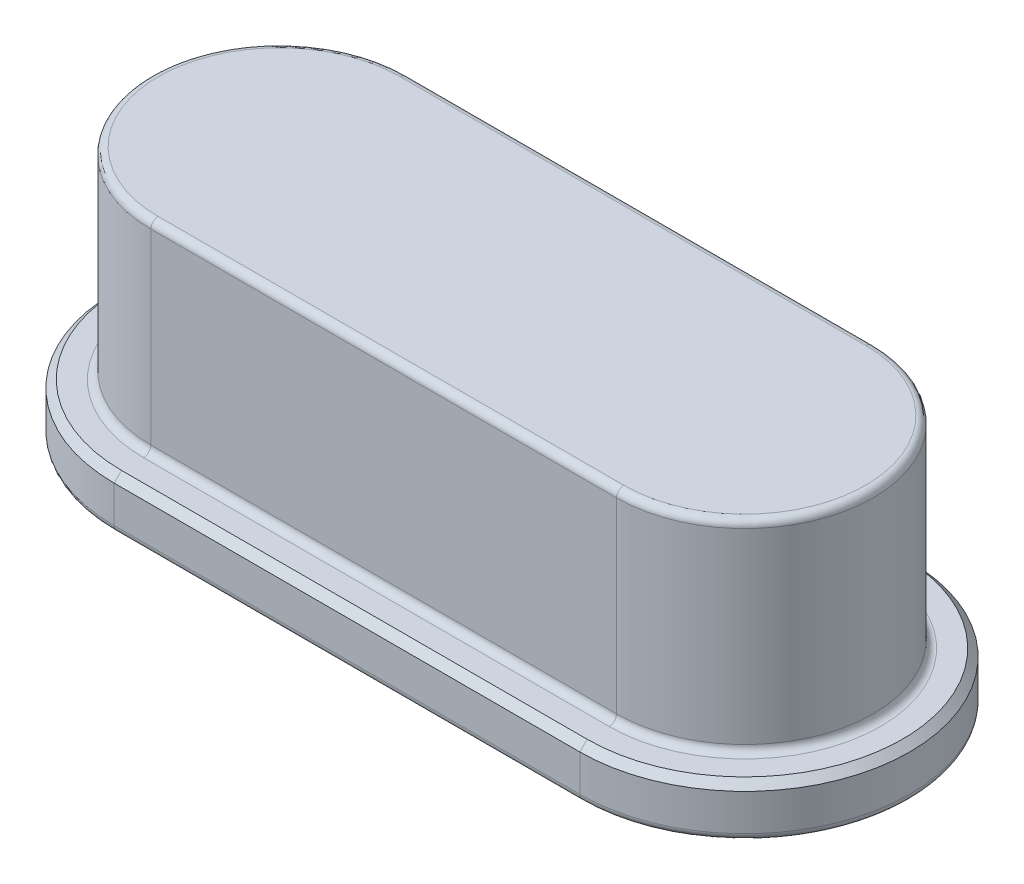
ISO-10303-21;
HEADER;
FILE_DESCRIPTION(('STEP AP214'),'2;1');
FILE_NAME('part.step','',(''),(''),'','','');
FILE_SCHEMA(('AUTOMOTIVE_DESIGN { 1 0 10303 214 1 1 1 1 }'));
ENDSEC;
DATA;
#1=APPLICATION_CONTEXT('core data for automotive mechanical design processes');
#2=APPLICATION_PROTOCOL_DEFINITION('international standard','automotive_design',2000,#1);
#3=PRODUCT_CONTEXT('',#1,'mechanical');
#4=PRODUCT('Part','Part','',(#3));
#5=PRODUCT_RELATED_PRODUCT_CATEGORY('part','',(#4));
#6=PRODUCT_DEFINITION_FORMATION('','',#4);
#7=PRODUCT_DEFINITION_CONTEXT('part definition',#1,'design');
#8=PRODUCT_DEFINITION('design','',#6,#7);
#9=PRODUCT_DEFINITION_SHAPE('','',#8);
#10=(LENGTH_UNIT() NAMED_UNIT(*) SI_UNIT(.MILLI.,.METRE.));
#11=(NAMED_UNIT(*) PLANE_ANGLE_UNIT() SI_UNIT($,.RADIAN.));
#12=(NAMED_UNIT(*) SI_UNIT($,.STERADIAN.) SOLID_ANGLE_UNIT());
#13=UNCERTAINTY_MEASURE_WITH_UNIT(LENGTH_MEASURE(1.E-05),#10,'distance_accuracy_value','');
#14=(GEOMETRIC_REPRESENTATION_CONTEXT(3) GLOBAL_UNCERTAINTY_ASSIGNED_CONTEXT((#13)) GLOBAL_UNIT_ASSIGNED_CONTEXT((#10,
#11,#12)) REPRESENTATION_CONTEXT('',''));
#15=CARTESIAN_POINT('',(0.,0.,0.));
#16=DIRECTION('',(0.,0.,1.));
#17=DIRECTION('',(1.,0.,0.));
#18=AXIS2_PLACEMENT_3D('',#15,#16,#17);
#19=CARTESIAN_POINT('',(0.,0.7,0.));
#20=DIRECTION('',(0.,1.,0.));
#21=DIRECTION('',(0.,0.,1.));
#22=AXIS2_PLACEMENT_3D('',#19,#20,#21);
#23=PLANE('',#22);
#24=CARTESIAN_POINT('',(6.35,0.7,0.));
#25=DIRECTION('',(0.,1.,0.));
#26=DIRECTION('',(0.,0.,1.));
#27=AXIS2_PLACEMENT_3D('',#24,#25,#26);
#28=CIRCLE('',#27,2.15);
#29=CARTESIAN_POINT('',(6.35,0.7,2.15));
#30=VERTEX_POINT('',#29);
#31=CARTESIAN_POINT('',(6.35,0.7,-2.15));
#32=VERTEX_POINT('',#31);
#33=EDGE_CURVE('E266',#30,#32,#28,.T.);
#34=ORIENTED_EDGE('',*,*,#33,.T.);
#35=DIRECTION('',(-1.,0.,0.));
#36=VECTOR('',#35,1.);
#37=CARTESIAN_POINT('',(0.,0.7,-2.15));
#38=LINE('',#37,#36);
#39=CARTESIAN_POINT('',(0.,0.7,-2.15));
#40=VERTEX_POINT('',#39);
#41=EDGE_CURVE('E268',#32,#40,#38,.T.);
#42=ORIENTED_EDGE('',*,*,#41,.T.);
#43=CARTESIAN_POINT('',(0.,0.7,0.));
#44=DIRECTION('',(0.,1.,0.));
#45=DIRECTION('',(0.,0.,1.));
#46=AXIS2_PLACEMENT_3D('',#43,#44,#45);
#47=CIRCLE('',#46,2.15);
#48=CARTESIAN_POINT('',(0.,0.7,2.15));
#49=VERTEX_POINT('',#48);
#50=EDGE_CURVE('E252',#40,#49,#47,.T.);
#51=ORIENTED_EDGE('',*,*,#50,.T.);
#52=DIRECTION('',(1.,0.,0.));
#53=VECTOR('',#52,1.);
#54=CARTESIAN_POINT('',(6.35,0.7,2.15));
#55=LINE('',#54,#53);
#56=EDGE_CURVE('E264',#49,#30,#55,.T.);
#57=ORIENTED_EDGE('',*,*,#56,.T.);
#58=EDGE_LOOP('',(#34,#42,#51,#57));
#59=FACE_BOUND('',#58,.T.);
#60=CARTESIAN_POINT('',(0.,0.7,0.));
#61=DIRECTION('',(0.,1.,0.));
#62=DIRECTION('',(0.,0.,1.));
#63=AXIS2_PLACEMENT_3D('',#60,#61,#62);
#64=CIRCLE('',#63,1.85);
#65=CARTESIAN_POINT('',(0.,0.7,1.85));
#66=VERTEX_POINT('',#65);
#67=CARTESIAN_POINT('',(0.,0.7,-1.85));
#68=VERTEX_POINT('',#67);
#69=EDGE_CURVE('E185',#66,#68,#64,.F.);
#70=ORIENTED_EDGE('',*,*,#69,.T.);
#71=DIRECTION('',(-1.,0.,0.));
#72=VECTOR('',#71,1.);
#73=CARTESIAN_POINT('',(0.,0.7,-1.85));
#74=LINE('',#73,#72);
#75=CARTESIAN_POINT('',(6.35,0.7,-1.85));
#76=VERTEX_POINT('',#75);
#77=EDGE_CURVE('E169',#68,#76,#74,.F.);
#78=ORIENTED_EDGE('',*,*,#77,.T.);
#79=CARTESIAN_POINT('',(6.35,0.7,0.));
#80=DIRECTION('',(0.,1.,0.));
#81=DIRECTION('',(0.,0.,1.));
#82=AXIS2_PLACEMENT_3D('',#79,#80,#81);
#83=CIRCLE('',#82,1.85);
#84=CARTESIAN_POINT('',(6.35,0.7,1.85));
#85=VERTEX_POINT('',#84);
#86=EDGE_CURVE('E195',#76,#85,#83,.F.);
#87=ORIENTED_EDGE('',*,*,#86,.T.);
#88=DIRECTION('',(1.,0.,0.));
#89=VECTOR('',#88,1.);
#90=CARTESIAN_POINT('',(0.,0.7,1.85));
#91=LINE('',#90,#89);
#92=EDGE_CURVE('E188',#85,#66,#91,.F.);
#93=ORIENTED_EDGE('',*,*,#92,.T.);
#94=EDGE_LOOP('',(#70,#78,#87,#93));
#95=FACE_BOUND('',#94,.T.);
#96=ADVANCED_FACE('F32',(#59,#95),#23,.T.);
#97=CARTESIAN_POINT('',(0.,0.7,0.));
#98=DIRECTION('',(0.,-1.,0.));
#99=DIRECTION('',(0.,0.,-1.));
#100=AXIS2_PLACEMENT_3D('',#97,#98,#99);
#101=CYLINDRICAL_SURFACE('',#100,2.25);
#102=DIRECTION('',(0.,-1.,0.));
#103=VECTOR('',#102,1.);
#104=CARTESIAN_POINT('',(0.,0.7,2.25));
#105=LINE('',#104,#103);
#106=CARTESIAN_POINT('',(0.,0.600000000000002,2.25));
#107=VERTEX_POINT('',#106);
#108=CARTESIAN_POINT('',(0.,0.1,2.25));
#109=VERTEX_POINT('',#108);
#110=EDGE_CURVE('E186',#107,#109,#105,.T.);
#111=ORIENTED_EDGE('',*,*,#110,.F.);
#112=CARTESIAN_POINT('',(0.,0.600000000000002,0.));
#113=DIRECTION('',(0.,1.,0.));
#114=DIRECTION('',(0.,0.,1.));
#115=AXIS2_PLACEMENT_3D('',#112,#113,#114);
#116=CIRCLE('',#115,2.25);
#117=CARTESIAN_POINT('',(0.,0.600000000000002,-2.25));
#118=VERTEX_POINT('',#117);
#119=EDGE_CURVE('E11',#107,#118,#116,.F.);
#120=ORIENTED_EDGE('',*,*,#119,.T.);
#121=DIRECTION('',(0.,-1.,0.));
#122=VECTOR('',#121,1.);
#123=CARTESIAN_POINT('',(0.,0.7,-2.25));
#124=LINE('',#123,#122);
#125=CARTESIAN_POINT('',(0.,0.1,-2.25));
#126=VERTEX_POINT('',#125);
#127=EDGE_CURVE('E298',#118,#126,#124,.T.);
#128=ORIENTED_EDGE('',*,*,#127,.T.);
#129=CARTESIAN_POINT('',(0.,0.1,0.));
#130=DIRECTION('',(0.,1.,0.));
#131=DIRECTION('',(0.,0.,1.));
#132=AXIS2_PLACEMENT_3D('',#129,#130,#131);
#133=CIRCLE('',#132,2.25);
#134=EDGE_CURVE('E243',#126,#109,#133,.T.);
#135=ORIENTED_EDGE('',*,*,#134,.T.);
#136=EDGE_LOOP('',(#111,#120,#128,#135));
#137=FACE_BOUND('',#136,.T.);
#138=ADVANCED_FACE('F297',(#137),#101,.T.);
#139=CARTESIAN_POINT('',(0.,0.7,2.25));
#140=DIRECTION('',(0.,0.,-1.));
#141=DIRECTION('',(-1.,0.,0.));
#142=AXIS2_PLACEMENT_3D('',#139,#140,#141);
#143=PLANE('',#142);
#144=DIRECTION('',(0.,-1.,0.));
#145=VECTOR('',#144,1.);
#146=CARTESIAN_POINT('',(6.35,0.7,2.25));
#147=LINE('',#146,#145);
#148=CARTESIAN_POINT('',(6.35,0.600000000000002,2.25));
#149=VERTEX_POINT('',#148);
#150=CARTESIAN_POINT('',(6.35,0.1,2.25));
#151=VERTEX_POINT('',#150);
#152=EDGE_CURVE('E190',#149,#151,#147,.T.);
#153=ORIENTED_EDGE('',*,*,#152,.F.);
#154=DIRECTION('',(-1.,0.,0.));
#155=VECTOR('',#154,1.);
#156=CARTESIAN_POINT('',(0.,0.600000000000002,2.25));
#157=LINE('',#156,#155);
#158=EDGE_CURVE('E41',#149,#107,#157,.T.);
#159=ORIENTED_EDGE('',*,*,#158,.T.);
#160=ORIENTED_EDGE('',*,*,#110,.T.);
#161=DIRECTION('',(1.,0.,0.));
#162=VECTOR('',#161,1.);
#163=CARTESIAN_POINT('',(0.,0.1,2.25));
#164=LINE('',#163,#162);
#165=EDGE_CURVE('E246',#109,#151,#164,.T.);
#166=ORIENTED_EDGE('',*,*,#165,.T.);
#167=EDGE_LOOP('',(#153,#159,#160,#166));
#168=FACE_BOUND('',#167,.T.);
#169=ADVANCED_FACE('F334',(#168),#143,.F.);
#170=CARTESIAN_POINT('',(6.35,0.7,0.));
#171=DIRECTION('',(0.,-1.,0.));
#172=DIRECTION('',(0.,0.,-1.));
#173=AXIS2_PLACEMENT_3D('',#170,#171,#172);
#174=CYLINDRICAL_SURFACE('',#173,2.25);
#175=DIRECTION('',(0.,-1.,0.));
#176=VECTOR('',#175,1.);
#177=CARTESIAN_POINT('',(6.35,0.7,-2.25));
#178=LINE('',#177,#176);
#179=CARTESIAN_POINT('',(6.35,0.600000000000002,-2.25));
#180=VERTEX_POINT('',#179);
#181=CARTESIAN_POINT('',(6.35,0.1,-2.25));
#182=VERTEX_POINT('',#181);
#183=EDGE_CURVE('E303',#180,#182,#178,.T.);
#184=ORIENTED_EDGE('',*,*,#183,.F.);
#185=CARTESIAN_POINT('',(6.35,0.600000000000002,0.));
#186=DIRECTION('',(0.,1.,0.));
#187=DIRECTION('',(0.,0.,1.));
#188=AXIS2_PLACEMENT_3D('',#185,#186,#187);
#189=CIRCLE('',#188,2.25);
#190=EDGE_CURVE('E56',#180,#149,#189,.F.);
#191=ORIENTED_EDGE('',*,*,#190,.T.);
#192=ORIENTED_EDGE('',*,*,#152,.T.);
#193=CARTESIAN_POINT('',(6.35,0.1,0.));
#194=DIRECTION('',(0.,1.,0.));
#195=DIRECTION('',(0.,0.,1.));
#196=AXIS2_PLACEMENT_3D('',#193,#194,#195);
#197=CIRCLE('',#196,2.25);
#198=EDGE_CURVE('E249',#151,#182,#197,.T.);
#199=ORIENTED_EDGE('',*,*,#198,.T.);
#200=EDGE_LOOP('',(#184,#191,#192,#199));
#201=FACE_BOUND('',#200,.T.);
#202=ADVANCED_FACE('F329',(#201),#174,.T.);
#203=CARTESIAN_POINT('',(0.,0.7,-2.25));
#204=DIRECTION('',(0.,0.,1.));
#205=DIRECTION('',(1.,0.,0.));
#206=AXIS2_PLACEMENT_3D('',#203,#204,#205);
#207=PLANE('',#206);
#208=ORIENTED_EDGE('',*,*,#127,.F.);
#209=DIRECTION('',(1.,0.,0.));
#210=VECTOR('',#209,1.);
#211=CARTESIAN_POINT('',(6.35,0.600000000000002,-2.25));
#212=LINE('',#211,#210);
#213=EDGE_CURVE('E271',#118,#180,#212,.T.);
#214=ORIENTED_EDGE('',*,*,#213,.T.);
#215=ORIENTED_EDGE('',*,*,#183,.T.);
#216=DIRECTION('',(-1.,0.,0.));
#217=VECTOR('',#216,1.);
#218=CARTESIAN_POINT('',(0.,0.1,-2.25));
#219=LINE('',#218,#217);
#220=EDGE_CURVE('E221',#182,#126,#219,.T.);
#221=ORIENTED_EDGE('',*,*,#220,.T.);
#222=EDGE_LOOP('',(#208,#214,#215,#221));
#223=FACE_BOUND('',#222,.T.);
#224=ADVANCED_FACE('F301',(#223),#207,.F.);
#225=CARTESIAN_POINT('',(0.,0.,0.));
#226=DIRECTION('',(0.,1.,0.));
#227=DIRECTION('',(0.,0.,1.));
#228=AXIS2_PLACEMENT_3D('',#225,#226,#227);
#229=PLANE('',#228);
#230=CARTESIAN_POINT('',(0.,0.,0.));
#231=DIRECTION('',(0.,1.,0.));
#232=DIRECTION('',(0.,0.,1.));
#233=AXIS2_PLACEMENT_3D('',#230,#231,#232);
#234=CIRCLE('',#233,2.15);
#235=CARTESIAN_POINT('',(0.,0.,2.15));
#236=VERTEX_POINT('',#235);
#237=CARTESIAN_POINT('',(0.,0.,-2.15));
#238=VERTEX_POINT('',#237);
#239=EDGE_CURVE('E238',#236,#238,#234,.F.);
#240=ORIENTED_EDGE('',*,*,#239,.T.);
#241=DIRECTION('',(-1.,0.,0.));
#242=VECTOR('',#241,1.);
#243=CARTESIAN_POINT('',(0.,0.,-2.15));
#244=LINE('',#243,#242);
#245=CARTESIAN_POINT('',(6.35,0.,-2.15));
#246=VERTEX_POINT('',#245);
#247=EDGE_CURVE('E240',#238,#246,#244,.F.);
#248=ORIENTED_EDGE('',*,*,#247,.T.);
#249=CARTESIAN_POINT('',(6.35,0.,0.));
#250=DIRECTION('',(0.,1.,0.));
#251=DIRECTION('',(0.,0.,1.));
#252=AXIS2_PLACEMENT_3D('',#249,#250,#251);
#253=CIRCLE('',#252,2.15);
#254=CARTESIAN_POINT('',(6.35,0.,2.15));
#255=VERTEX_POINT('',#254);
#256=EDGE_CURVE('E234',#246,#255,#253,.F.);
#257=ORIENTED_EDGE('',*,*,#256,.T.);
#258=DIRECTION('',(1.,0.,0.));
#259=VECTOR('',#258,1.);
#260=CARTESIAN_POINT('',(0.,0.,2.15));
#261=LINE('',#260,#259);
#262=EDGE_CURVE('E236',#255,#236,#261,.F.);
#263=ORIENTED_EDGE('',*,*,#262,.T.);
#264=EDGE_LOOP('',(#240,#248,#257,#263));
#265=FACE_BOUND('',#264,.T.);
#266=ADVANCED_FACE('F351',(#265),#229,.F.);
#267=CARTESIAN_POINT('',(0.,3.45,0.));
#268=DIRECTION('',(0.,-1.,0.));
#269=DIRECTION('',(0.,0.,-1.));
#270=AXIS2_PLACEMENT_3D('',#267,#268,#269);
#271=CYLINDRICAL_SURFACE('',#270,1.75);
#272=DIRECTION('',(0.,-1.,0.));
#273=VECTOR('',#272,1.);
#274=CARTESIAN_POINT('',(0.,3.45,1.75));
#275=LINE('',#274,#273);
#276=CARTESIAN_POINT('',(0.,3.35,1.75));
#277=VERTEX_POINT('',#276);
#278=CARTESIAN_POINT('',(0.,0.8,1.75));
#279=VERTEX_POINT('',#278);
#280=EDGE_CURVE('E304',#277,#279,#275,.T.);
#281=ORIENTED_EDGE('',*,*,#280,.F.);
#282=CARTESIAN_POINT('',(0.,3.35,0.));
#283=DIRECTION('',(0.,1.,0.));
#284=DIRECTION('',(0.,0.,1.));
#285=AXIS2_PLACEMENT_3D('',#282,#283,#284);
#286=CIRCLE('',#285,1.75);
#287=CARTESIAN_POINT('',(0.,3.35,-1.75));
#288=VERTEX_POINT('',#287);
#289=EDGE_CURVE('E155',#277,#288,#286,.F.);
#290=ORIENTED_EDGE('',*,*,#289,.T.);
#291=DIRECTION('',(0.,-1.,0.));
#292=VECTOR('',#291,1.);
#293=CARTESIAN_POINT('',(0.,3.45,-1.75));
#294=LINE('',#293,#292);
#295=CARTESIAN_POINT('',(0.,0.8,-1.75));
#296=VERTEX_POINT('',#295);
#297=EDGE_CURVE('E147',#288,#296,#294,.T.);
#298=ORIENTED_EDGE('',*,*,#297,.T.);
#299=CARTESIAN_POINT('',(0.,0.8,0.));
#300=DIRECTION('',(0.,1.,0.));
#301=DIRECTION('',(0.,0.,1.));
#302=AXIS2_PLACEMENT_3D('',#299,#300,#301);
#303=CIRCLE('',#302,1.75);
#304=EDGE_CURVE('E152',#296,#279,#303,.T.);
#305=ORIENTED_EDGE('',*,*,#304,.T.);
#306=EDGE_LOOP('',(#281,#290,#298,#305));
#307=FACE_BOUND('',#306,.T.);
#308=ADVANCED_FACE('F150',(#307),#271,.T.);
#309=CARTESIAN_POINT('',(0.,3.45,1.75));
#310=DIRECTION('',(0.,0.,-1.));
#311=DIRECTION('',(-1.,0.,0.));
#312=AXIS2_PLACEMENT_3D('',#309,#310,#311);
#313=PLANE('',#312);
#314=DIRECTION('',(0.,-1.,0.));
#315=VECTOR('',#314,1.);
#316=CARTESIAN_POINT('',(6.35,3.45,1.75));
#317=LINE('',#316,#315);
#318=CARTESIAN_POINT('',(6.35,3.35,1.75));
#319=VERTEX_POINT('',#318);
#320=CARTESIAN_POINT('',(6.35,0.8,1.75));
#321=VERTEX_POINT('',#320);
#322=EDGE_CURVE('E322',#319,#321,#317,.T.);
#323=ORIENTED_EDGE('',*,*,#322,.F.);
#324=DIRECTION('',(1.,0.,0.));
#325=VECTOR('',#324,1.);
#326=CARTESIAN_POINT('',(0.,3.35,1.75));
#327=LINE('',#326,#325);
#328=EDGE_CURVE('E215',#319,#277,#327,.F.);
#329=ORIENTED_EDGE('',*,*,#328,.T.);
#330=ORIENTED_EDGE('',*,*,#280,.T.);
#331=DIRECTION('',(1.,0.,0.));
#332=VECTOR('',#331,1.);
#333=CARTESIAN_POINT('',(0.,0.8,1.75));
#334=LINE('',#333,#332);
#335=EDGE_CURVE('E180',#279,#321,#334,.T.);
#336=ORIENTED_EDGE('',*,*,#335,.T.);
#337=EDGE_LOOP('',(#323,#329,#330,#336));
#338=FACE_BOUND('',#337,.T.);
#339=ADVANCED_FACE('F321',(#338),#313,.F.);
#340=CARTESIAN_POINT('',(6.35,3.45,0.));
#341=DIRECTION('',(0.,-1.,0.));
#342=DIRECTION('',(0.,0.,-1.));
#343=AXIS2_PLACEMENT_3D('',#340,#341,#342);
#344=CYLINDRICAL_SURFACE('',#343,1.75);
#345=DIRECTION('',(0.,-1.,0.));
#346=VECTOR('',#345,1.);
#347=CARTESIAN_POINT('',(6.35,3.45,-1.75));
#348=LINE('',#347,#346);
#349=CARTESIAN_POINT('',(6.35,3.35,-1.75));
#350=VERTEX_POINT('',#349);
#351=CARTESIAN_POINT('',(6.35,0.8,-1.75));
#352=VERTEX_POINT('',#351);
#353=EDGE_CURVE('E158',#350,#352,#348,.T.);
#354=ORIENTED_EDGE('',*,*,#353,.F.);
#355=CARTESIAN_POINT('',(6.35,3.35,0.));
#356=DIRECTION('',(0.,1.,0.));
#357=DIRECTION('',(0.,0.,1.));
#358=AXIS2_PLACEMENT_3D('',#355,#356,#357);
#359=CIRCLE('',#358,1.75);
#360=EDGE_CURVE('E219',#350,#319,#359,.F.);
#361=ORIENTED_EDGE('',*,*,#360,.T.);
#362=ORIENTED_EDGE('',*,*,#322,.T.);
#363=CARTESIAN_POINT('',(6.35,0.8,0.));
#364=DIRECTION('',(0.,1.,0.));
#365=DIRECTION('',(0.,0.,1.));
#366=AXIS2_PLACEMENT_3D('',#363,#364,#365);
#367=CIRCLE('',#366,1.75);
#368=EDGE_CURVE('E198',#321,#352,#367,.T.);
#369=ORIENTED_EDGE('',*,*,#368,.T.);
#370=EDGE_LOOP('',(#354,#361,#362,#369));
#371=FACE_BOUND('',#370,.T.);
#372=ADVANCED_FACE('F475',(#371),#344,.T.);
#373=CARTESIAN_POINT('',(0.,3.45,-1.75));
#374=DIRECTION('',(0.,0.,1.));
#375=DIRECTION('',(1.,0.,0.));
#376=AXIS2_PLACEMENT_3D('',#373,#374,#375);
#377=PLANE('',#376);
#378=ORIENTED_EDGE('',*,*,#297,.F.);
#379=DIRECTION('',(-1.,0.,0.));
#380=VECTOR('',#379,1.);
#381=CARTESIAN_POINT('',(6.35,3.35,-1.75));
#382=LINE('',#381,#380);
#383=EDGE_CURVE('E217',#288,#350,#382,.F.);
#384=ORIENTED_EDGE('',*,*,#383,.T.);
#385=ORIENTED_EDGE('',*,*,#353,.T.);
#386=DIRECTION('',(-1.,0.,0.));
#387=VECTOR('',#386,1.);
#388=CARTESIAN_POINT('',(0.,0.8,-1.75));
#389=LINE('',#388,#387);
#390=EDGE_CURVE('E167',#352,#296,#389,.T.);
#391=ORIENTED_EDGE('',*,*,#390,.T.);
#392=EDGE_LOOP('',(#378,#384,#385,#391));
#393=FACE_BOUND('',#392,.T.);
#394=ADVANCED_FACE('F182',(#393),#377,.F.);
#395=CARTESIAN_POINT('',(0.,3.45,0.));
#396=DIRECTION('',(0.,1.,0.));
#397=DIRECTION('',(0.,0.,1.));
#398=AXIS2_PLACEMENT_3D('',#395,#396,#397);
#399=PLANE('',#398);
#400=DIRECTION('',(-1.,0.,0.));
#401=VECTOR('',#400,1.);
#402=CARTESIAN_POINT('',(0.,3.45,-1.65));
#403=LINE('',#402,#401);
#404=CARTESIAN_POINT('',(6.35,3.45,-1.65));
#405=VERTEX_POINT('',#404);
#406=CARTESIAN_POINT('',(0.,3.45,-1.65));
#407=VERTEX_POINT('',#406);
#408=EDGE_CURVE('E207',#405,#407,#403,.T.);
#409=ORIENTED_EDGE('',*,*,#408,.T.);
#410=CARTESIAN_POINT('',(0.,3.45,0.));
#411=DIRECTION('',(0.,1.,0.));
#412=DIRECTION('',(0.,0.,1.));
#413=AXIS2_PLACEMENT_3D('',#410,#411,#412);
#414=CIRCLE('',#413,1.65);
#415=CARTESIAN_POINT('',(0.,3.45,1.65));
#416=VERTEX_POINT('',#415);
#417=EDGE_CURVE('E211',#407,#416,#414,.T.);
#418=ORIENTED_EDGE('',*,*,#417,.T.);
#419=DIRECTION('',(1.,0.,0.));
#420=VECTOR('',#419,1.);
#421=CARTESIAN_POINT('',(6.35,3.45,1.65));
#422=LINE('',#421,#420);
#423=CARTESIAN_POINT('',(6.35,3.45,1.65));
#424=VERTEX_POINT('',#423);
#425=EDGE_CURVE('E209',#416,#424,#422,.T.);
#426=ORIENTED_EDGE('',*,*,#425,.T.);
#427=CARTESIAN_POINT('',(6.35,3.45,0.));
#428=DIRECTION('',(0.,1.,0.));
#429=DIRECTION('',(0.,0.,1.));
#430=AXIS2_PLACEMENT_3D('',#427,#428,#429);
#431=CIRCLE('',#430,1.65);
#432=EDGE_CURVE('E179',#424,#405,#431,.T.);
#433=ORIENTED_EDGE('',*,*,#432,.T.);
#434=EDGE_LOOP('',(#409,#418,#426,#433));
#435=FACE_BOUND('',#434,.T.);
#436=ADVANCED_FACE('F378',(#435),#399,.T.);
#437=CARTESIAN_POINT('',(0.,0.8,1.85));
#438=DIRECTION('',(1.,0.,0.));
#439=DIRECTION('',(0.,0.,-1.));
#440=AXIS2_PLACEMENT_3D('',#437,#438,#439);
#441=CYLINDRICAL_SURFACE('',#440,0.1);
#442=CARTESIAN_POINT('',(0.,0.8,1.85));
#443=DIRECTION('',(1.,0.,0.));
#444=DIRECTION('',(0.,0.,-1.));
#445=AXIS2_PLACEMENT_3D('',#442,#443,#444);
#446=CIRCLE('',#445,0.1);
#447=EDGE_CURVE('E178',#66,#279,#446,.T.);
#448=ORIENTED_EDGE('',*,*,#447,.F.);
#449=ORIENTED_EDGE('',*,*,#92,.F.);
#450=CARTESIAN_POINT('',(6.35,0.8,1.85));
#451=DIRECTION('',(-1.,0.,0.));
#452=DIRECTION('',(0.,0.,1.));
#453=AXIS2_PLACEMENT_3D('',#450,#451,#452);
#454=CIRCLE('',#453,0.1);
#455=EDGE_CURVE('E159',#321,#85,#454,.T.);
#456=ORIENTED_EDGE('',*,*,#455,.F.);
#457=ORIENTED_EDGE('',*,*,#335,.F.);
#458=EDGE_LOOP('',(#448,#449,#456,#457));
#459=FACE_BOUND('',#458,.T.);
#460=ADVANCED_FACE('F317',(#459),#441,.F.);
#461=CARTESIAN_POINT('',(6.35,0.8,0.));
#462=DIRECTION('',(0.,1.,0.));
#463=DIRECTION('',(0.,0.,1.));
#464=AXIS2_PLACEMENT_3D('',#461,#462,#463);
#465=TOROIDAL_SURFACE('',#464,1.85,0.1);
#466=ORIENTED_EDGE('',*,*,#455,.T.);
#467=ORIENTED_EDGE('',*,*,#86,.F.);
#468=CARTESIAN_POINT('',(6.35,0.8,-1.85));
#469=DIRECTION('',(1.,0.,0.));
#470=DIRECTION('',(0.,0.,-1.));
#471=AXIS2_PLACEMENT_3D('',#468,#469,#470);
#472=CIRCLE('',#471,0.1);
#473=EDGE_CURVE('E172',#352,#76,#472,.T.);
#474=ORIENTED_EDGE('',*,*,#473,.F.);
#475=ORIENTED_EDGE('',*,*,#368,.F.);
#476=EDGE_LOOP('',(#466,#467,#474,#475));
#477=FACE_BOUND('',#476,.T.);
#478=ADVANCED_FACE('F372',(#477),#465,.F.);
#479=CARTESIAN_POINT('',(0.,0.8,0.));
#480=DIRECTION('',(0.,1.,0.));
#481=DIRECTION('',(0.,0.,1.));
#482=AXIS2_PLACEMENT_3D('',#479,#480,#481);
#483=TOROIDAL_SURFACE('',#482,1.85,0.1);
#484=ORIENTED_EDGE('',*,*,#447,.T.);
#485=ORIENTED_EDGE('',*,*,#304,.F.);
#486=CARTESIAN_POINT('',(0.,0.8,-1.85));
#487=DIRECTION('',(-1.,0.,0.));
#488=DIRECTION('',(0.,0.,1.));
#489=AXIS2_PLACEMENT_3D('',#486,#487,#488);
#490=CIRCLE('',#489,0.1);
#491=EDGE_CURVE('E165',#68,#296,#490,.T.);
#492=ORIENTED_EDGE('',*,*,#491,.F.);
#493=ORIENTED_EDGE('',*,*,#69,.F.);
#494=EDGE_LOOP('',(#484,#485,#492,#493));
#495=FACE_BOUND('',#494,.T.);
#496=ADVANCED_FACE('F176',(#495),#483,.F.);
#497=CARTESIAN_POINT('',(0.,0.8,-1.85));
#498=DIRECTION('',(-1.,0.,0.));
#499=DIRECTION('',(0.,0.,1.));
#500=AXIS2_PLACEMENT_3D('',#497,#498,#499);
#501=CYLINDRICAL_SURFACE('',#500,0.1);
#502=ORIENTED_EDGE('',*,*,#473,.T.);
#503=ORIENTED_EDGE('',*,*,#77,.F.);
#504=ORIENTED_EDGE('',*,*,#491,.T.);
#505=ORIENTED_EDGE('',*,*,#390,.F.);
#506=EDGE_LOOP('',(#502,#503,#504,#505));
#507=FACE_BOUND('',#506,.T.);
#508=ADVANCED_FACE('F166',(#507),#501,.F.);
#509=CARTESIAN_POINT('',(6.35,3.35,0.));
#510=DIRECTION('',(0.,1.,0.));
#511=DIRECTION('',(0.,0.,1.));
#512=AXIS2_PLACEMENT_3D('',#509,#510,#511);
#513=TOROIDAL_SURFACE('',#512,1.65,0.1);
#514=CARTESIAN_POINT('',(6.35,3.35,1.65));
#515=DIRECTION('',(-1.,0.,0.));
#516=DIRECTION('',(0.,0.,1.));
#517=AXIS2_PLACEMENT_3D('',#514,#515,#516);
#518=CIRCLE('',#517,0.1);
#519=EDGE_CURVE('E227',#319,#424,#518,.T.);
#520=ORIENTED_EDGE('',*,*,#519,.F.);
#521=ORIENTED_EDGE('',*,*,#360,.F.);
#522=CARTESIAN_POINT('',(6.35,3.35,-1.65));
#523=DIRECTION('',(-1.,0.,0.));
#524=DIRECTION('',(0.,0.,1.));
#525=AXIS2_PLACEMENT_3D('',#522,#523,#524);
#526=CIRCLE('',#525,0.1);
#527=EDGE_CURVE('E173',#405,#350,#526,.T.);
#528=ORIENTED_EDGE('',*,*,#527,.F.);
#529=ORIENTED_EDGE('',*,*,#432,.F.);
#530=EDGE_LOOP('',(#520,#521,#528,#529));
#531=FACE_BOUND('',#530,.T.);
#532=ADVANCED_FACE('F369',(#531),#513,.T.);
#533=CARTESIAN_POINT('',(0.,3.35,-1.65));
#534=DIRECTION('',(1.,0.,0.));
#535=DIRECTION('',(0.,0.,-1.));
#536=AXIS2_PLACEMENT_3D('',#533,#534,#535);
#537=CYLINDRICAL_SURFACE('',#536,0.1);
#538=ORIENTED_EDGE('',*,*,#527,.T.);
#539=ORIENTED_EDGE('',*,*,#383,.F.);
#540=CARTESIAN_POINT('',(0.,3.35,-1.65));
#541=DIRECTION('',(-1.,0.,0.));
#542=DIRECTION('',(0.,0.,1.));
#543=AXIS2_PLACEMENT_3D('',#540,#541,#542);
#544=CIRCLE('',#543,0.1);
#545=EDGE_CURVE('E224',#407,#288,#544,.T.);
#546=ORIENTED_EDGE('',*,*,#545,.F.);
#547=ORIENTED_EDGE('',*,*,#408,.F.);
#548=EDGE_LOOP('',(#538,#539,#546,#547));
#549=FACE_BOUND('',#548,.T.);
#550=ADVANCED_FACE('F386',(#549),#537,.T.);
#551=CARTESIAN_POINT('',(0.,3.35,1.65));
#552=DIRECTION('',(-1.,0.,0.));
#553=DIRECTION('',(0.,0.,1.));
#554=AXIS2_PLACEMENT_3D('',#551,#552,#553);
#555=CYLINDRICAL_SURFACE('',#554,0.1);
#556=ORIENTED_EDGE('',*,*,#519,.T.);
#557=ORIENTED_EDGE('',*,*,#425,.F.);
#558=CARTESIAN_POINT('',(0.,3.35,1.65));
#559=DIRECTION('',(-1.,0.,0.));
#560=DIRECTION('',(0.,-1.,0.));
#561=AXIS2_PLACEMENT_3D('',#558,#559,#560);
#562=CIRCLE('',#561,0.1);
#563=EDGE_CURVE('E222',#277,#416,#562,.T.);
#564=ORIENTED_EDGE('',*,*,#563,.F.);
#565=ORIENTED_EDGE('',*,*,#328,.F.);
#566=EDGE_LOOP('',(#556,#557,#564,#565));
#567=FACE_BOUND('',#566,.T.);
#568=ADVANCED_FACE('F382',(#567),#555,.T.);
#569=CARTESIAN_POINT('',(0.,3.35,0.));
#570=DIRECTION('',(0.,1.,0.));
#571=DIRECTION('',(0.,0.,1.));
#572=AXIS2_PLACEMENT_3D('',#569,#570,#571);
#573=TOROIDAL_SURFACE('',#572,1.65,0.1);
#574=ORIENTED_EDGE('',*,*,#545,.T.);
#575=ORIENTED_EDGE('',*,*,#289,.F.);
#576=ORIENTED_EDGE('',*,*,#563,.T.);
#577=ORIENTED_EDGE('',*,*,#417,.F.);
#578=EDGE_LOOP('',(#574,#575,#576,#577));
#579=FACE_BOUND('',#578,.T.);
#580=ADVANCED_FACE('F379',(#579),#573,.T.);
#581=CARTESIAN_POINT('',(0.,0.1,2.15));
#582=DIRECTION('',(1.,0.,0.));
#583=DIRECTION('',(0.,0.,-1.));
#584=AXIS2_PLACEMENT_3D('',#581,#582,#583);
#585=CYLINDRICAL_SURFACE('',#584,0.1);
#586=CARTESIAN_POINT('',(0.,0.1,2.15));
#587=DIRECTION('',(-1.,0.,0.));
#588=DIRECTION('',(0.,0.,1.));
#589=AXIS2_PLACEMENT_3D('',#586,#587,#588);
#590=CIRCLE('',#589,0.1);
#591=EDGE_CURVE('E258',#236,#109,#590,.T.);
#592=ORIENTED_EDGE('',*,*,#591,.F.);
#593=ORIENTED_EDGE('',*,*,#262,.F.);
#594=CARTESIAN_POINT('',(6.35,0.1,2.15));
#595=DIRECTION('',(1.,0.,0.));
#596=DIRECTION('',(0.,0.,-1.));
#597=AXIS2_PLACEMENT_3D('',#594,#595,#596);
#598=CIRCLE('',#597,0.1);
#599=EDGE_CURVE('E225',#151,#255,#598,.T.);
#600=ORIENTED_EDGE('',*,*,#599,.F.);
#601=ORIENTED_EDGE('',*,*,#165,.F.);
#602=EDGE_LOOP('',(#592,#593,#600,#601));
#603=FACE_BOUND('',#602,.T.);
#604=ADVANCED_FACE('F338',(#603),#585,.T.);
#605=CARTESIAN_POINT('',(6.35,0.1,0.));
#606=DIRECTION('',(0.,1.,0.));
#607=DIRECTION('',(0.,0.,1.));
#608=AXIS2_PLACEMENT_3D('',#605,#606,#607);
#609=TOROIDAL_SURFACE('',#608,2.15,0.1);
#610=ORIENTED_EDGE('',*,*,#599,.T.);
#611=ORIENTED_EDGE('',*,*,#256,.F.);
#612=CARTESIAN_POINT('',(6.35,0.1,-2.15));
#613=DIRECTION('',(-1.,0.,0.));
#614=DIRECTION('',(0.,0.,1.));
#615=AXIS2_PLACEMENT_3D('',#612,#613,#614);
#616=CIRCLE('',#615,0.1);
#617=EDGE_CURVE('E256',#182,#246,#616,.T.);
#618=ORIENTED_EDGE('',*,*,#617,.F.);
#619=ORIENTED_EDGE('',*,*,#198,.F.);
#620=EDGE_LOOP('',(#610,#611,#618,#619));
#621=FACE_BOUND('',#620,.T.);
#622=ADVANCED_FACE('F341',(#621),#609,.T.);
#623=CARTESIAN_POINT('',(0.,0.1,0.));
#624=DIRECTION('',(0.,1.,0.));
#625=DIRECTION('',(0.,0.,1.));
#626=AXIS2_PLACEMENT_3D('',#623,#624,#625);
#627=TOROIDAL_SURFACE('',#626,2.15,0.1);
#628=ORIENTED_EDGE('',*,*,#591,.T.);
#629=ORIENTED_EDGE('',*,*,#134,.F.);
#630=CARTESIAN_POINT('',(0.,0.1,-2.15));
#631=DIRECTION('',(1.,0.,0.));
#632=DIRECTION('',(0.,0.,-1.));
#633=AXIS2_PLACEMENT_3D('',#630,#631,#632);
#634=CIRCLE('',#633,0.1);
#635=EDGE_CURVE('E253',#238,#126,#634,.T.);
#636=ORIENTED_EDGE('',*,*,#635,.F.);
#637=ORIENTED_EDGE('',*,*,#239,.F.);
#638=EDGE_LOOP('',(#628,#629,#636,#637));
#639=FACE_BOUND('',#638,.T.);
#640=ADVANCED_FACE('F349',(#639),#627,.T.);
#641=CARTESIAN_POINT('',(0.,0.1,-2.15));
#642=DIRECTION('',(-1.,0.,0.));
#643=DIRECTION('',(0.,0.,1.));
#644=AXIS2_PLACEMENT_3D('',#641,#642,#643);
#645=CYLINDRICAL_SURFACE('',#644,0.1);
#646=ORIENTED_EDGE('',*,*,#617,.T.);
#647=ORIENTED_EDGE('',*,*,#247,.F.);
#648=ORIENTED_EDGE('',*,*,#635,.T.);
#649=ORIENTED_EDGE('',*,*,#220,.F.);
#650=EDGE_LOOP('',(#646,#647,#648,#649));
#651=FACE_BOUND('',#650,.T.);
#652=ADVANCED_FACE('F344',(#651),#645,.T.);
#653=CARTESIAN_POINT('',(0.,0.7,2.15));
#654=DIRECTION('',(0.,0.707106781186547,0.707106781186547));
#655=DIRECTION('',(-1.,0.,0.));
#656=AXIS2_PLACEMENT_3D('',#653,#654,#655);
#657=PLANE('',#656);
#658=DIRECTION('',(0.,0.707106781186547,-0.707106781186547));
#659=VECTOR('',#658,1.);
#660=CARTESIAN_POINT('',(0.,0.600000000000002,2.25));
#661=LINE('',#660,#659);
#662=EDGE_CURVE('E279',#107,#49,#661,.T.);
#663=ORIENTED_EDGE('',*,*,#662,.F.);
#664=ORIENTED_EDGE('',*,*,#158,.F.);
#665=DIRECTION('',(0.,-0.707106781186547,0.707106781186547));
#666=VECTOR('',#665,1.);
#667=CARTESIAN_POINT('',(6.35,0.7,2.15));
#668=LINE('',#667,#666);
#669=EDGE_CURVE('E36',#30,#149,#668,.T.);
#670=ORIENTED_EDGE('',*,*,#669,.F.);
#671=ORIENTED_EDGE('',*,*,#56,.F.);
#672=EDGE_LOOP('',(#663,#664,#670,#671));
#673=FACE_BOUND('',#672,.T.);
#674=ADVANCED_FACE('F34',(#673),#657,.T.);
#675=CARTESIAN_POINT('',(6.35,0.7,0.));
#676=DIRECTION('',(0.,-1.,0.));
#677=DIRECTION('',(0.,0.,-1.));
#678=AXIS2_PLACEMENT_3D('',#675,#676,#677);
#679=CONICAL_SURFACE('',#678,2.15,0.785398163397448);
#680=ORIENTED_EDGE('',*,*,#669,.T.);
#681=ORIENTED_EDGE('',*,*,#190,.F.);
#682=DIRECTION('',(0.,-0.707106781186547,-0.707106781186547));
#683=VECTOR('',#682,1.);
#684=CARTESIAN_POINT('',(6.35,0.7,-2.15));
#685=LINE('',#684,#683);
#686=EDGE_CURVE('E278',#32,#180,#685,.T.);
#687=ORIENTED_EDGE('',*,*,#686,.F.);
#688=ORIENTED_EDGE('',*,*,#33,.F.);
#689=EDGE_LOOP('',(#680,#681,#687,#688));
#690=FACE_BOUND('',#689,.T.);
#691=ADVANCED_FACE('F289',(#690),#679,.T.);
#692=CARTESIAN_POINT('',(0.,0.7,0.));
#693=DIRECTION('',(0.,-1.,0.));
#694=DIRECTION('',(0.,0.,-1.));
#695=AXIS2_PLACEMENT_3D('',#692,#693,#694);
#696=CONICAL_SURFACE('',#695,2.15,0.785398163397448);
#697=ORIENTED_EDGE('',*,*,#662,.T.);
#698=ORIENTED_EDGE('',*,*,#50,.F.);
#699=DIRECTION('',(0.,0.707106781186547,0.707106781186547));
#700=VECTOR('',#699,1.);
#701=CARTESIAN_POINT('',(0.,0.600000000000002,-2.25));
#702=LINE('',#701,#700);
#703=EDGE_CURVE('E276',#118,#40,#702,.T.);
#704=ORIENTED_EDGE('',*,*,#703,.F.);
#705=ORIENTED_EDGE('',*,*,#119,.F.);
#706=EDGE_LOOP('',(#697,#698,#704,#705));
#707=FACE_BOUND('',#706,.T.);
#708=ADVANCED_FACE('F294',(#707),#696,.T.);
#709=CARTESIAN_POINT('',(0.,0.7,-2.15));
#710=DIRECTION('',(0.,0.707106781186547,-0.707106781186547));
#711=DIRECTION('',(1.,0.,0.));
#712=AXIS2_PLACEMENT_3D('',#709,#710,#711);
#713=PLANE('',#712);
#714=ORIENTED_EDGE('',*,*,#686,.T.);
#715=ORIENTED_EDGE('',*,*,#213,.F.);
#716=ORIENTED_EDGE('',*,*,#703,.T.);
#717=ORIENTED_EDGE('',*,*,#41,.F.);
#718=EDGE_LOOP('',(#714,#715,#716,#717));
#719=FACE_BOUND('',#718,.T.);
#720=ADVANCED_FACE('F307',(#719),#713,.T.);
#721=CLOSED_SHELL('',(#96,#138,#169,#202,#224,#266,#308,#339,#372,#394,#436,#460,#478,#496,#508,
#532,#550,#568,#580,#604,#622,#640,#652,#674,#691,#708,#720));
#722=MANIFOLD_SOLID_BREP('B2',#721);
#723=ADVANCED_BREP_SHAPE_REPRESENTATION('',(#18,#722),#14);
#724=SHAPE_DEFINITION_REPRESENTATION(#9,#723);
ENDSEC;
END-ISO-10303-21;
